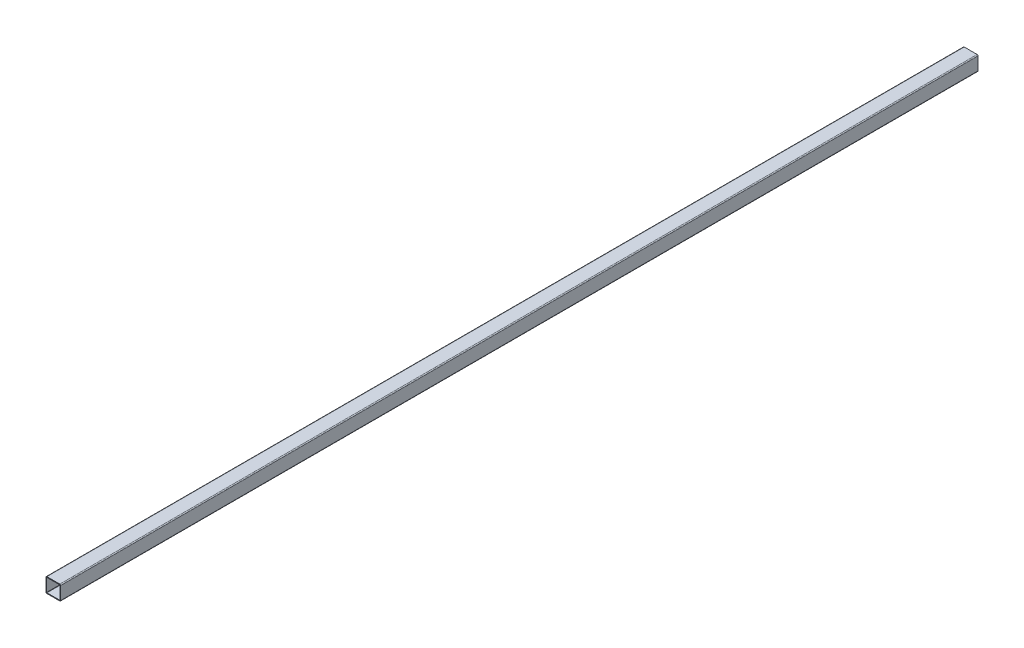
ISO-10303-21;
HEADER;
FILE_DESCRIPTION(('STEP AP214'),'2;1');
FILE_NAME('part.step','',(''),(''),'','','');
FILE_SCHEMA(('AUTOMOTIVE_DESIGN { 1 0 10303 214 1 1 1 1 }'));
ENDSEC;
DATA;
#1=APPLICATION_CONTEXT('core data for automotive mechanical design processes');
#2=APPLICATION_PROTOCOL_DEFINITION('international standard','automotive_design',2000,#1);
#3=PRODUCT_CONTEXT('',#1,'mechanical');
#4=PRODUCT('Part','Part','',(#3));
#5=PRODUCT_RELATED_PRODUCT_CATEGORY('part','',(#4));
#6=PRODUCT_DEFINITION_FORMATION('','',#4);
#7=PRODUCT_DEFINITION_CONTEXT('part definition',#1,'design');
#8=PRODUCT_DEFINITION('design','',#6,#7);
#9=PRODUCT_DEFINITION_SHAPE('','',#8);
#10=(LENGTH_UNIT() NAMED_UNIT(*) SI_UNIT(.MILLI.,.METRE.));
#11=(NAMED_UNIT(*) PLANE_ANGLE_UNIT() SI_UNIT($,.RADIAN.));
#12=(NAMED_UNIT(*) SI_UNIT($,.STERADIAN.) SOLID_ANGLE_UNIT());
#13=UNCERTAINTY_MEASURE_WITH_UNIT(LENGTH_MEASURE(1.E-05),#10,'distance_accuracy_value','');
#14=(GEOMETRIC_REPRESENTATION_CONTEXT(3) GLOBAL_UNCERTAINTY_ASSIGNED_CONTEXT((#13)) GLOBAL_UNIT_ASSIGNED_CONTEXT((#10,
#11,#12)) REPRESENTATION_CONTEXT('',''));
#15=CARTESIAN_POINT('',(0.,0.,0.));
#16=DIRECTION('',(0.,0.,1.));
#17=DIRECTION('',(1.,0.,0.));
#18=AXIS2_PLACEMENT_3D('',#15,#16,#17);
#19=CARTESIAN_POINT('',(14.,-14.,-1000.));
#20=DIRECTION('',(0.,0.,1.));
#21=DIRECTION('',(1.,0.,0.));
#22=AXIS2_PLACEMENT_3D('',#19,#20,#21);
#23=CYLINDRICAL_SURFACE('',#22,2.);
#24=DIRECTION('',(0.,0.,1.));
#25=VECTOR('',#24,1.);
#26=CARTESIAN_POINT('',(16.,-14.,-1000.));
#27=LINE('',#26,#25);
#28=CARTESIAN_POINT('',(16.,-14.,-1000.));
#29=VERTEX_POINT('',#28);
#30=CARTESIAN_POINT('',(16.,-14.,1000.));
#31=VERTEX_POINT('',#30);
#32=EDGE_CURVE('E42',#29,#31,#27,.T.);
#33=ORIENTED_EDGE('',*,*,#32,.T.);
#34=CARTESIAN_POINT('',(14.,-14.,1000.));
#35=DIRECTION('',(0.,0.,1.));
#36=DIRECTION('',(1.,0.,0.));
#37=AXIS2_PLACEMENT_3D('',#34,#35,#36);
#38=CIRCLE('',#37,2.);
#39=CARTESIAN_POINT('',(14.,-16.,1000.));
#40=VERTEX_POINT('',#39);
#41=EDGE_CURVE('E205',#40,#31,#38,.T.);
#42=ORIENTED_EDGE('',*,*,#41,.F.);
#43=DIRECTION('',(0.,0.,1.));
#44=VECTOR('',#43,1.);
#45=CARTESIAN_POINT('',(14.,-16.,-1000.));
#46=LINE('',#45,#44);
#47=CARTESIAN_POINT('',(14.,-16.,-1000.));
#48=VERTEX_POINT('',#47);
#49=EDGE_CURVE('E11',#48,#40,#46,.T.);
#50=ORIENTED_EDGE('',*,*,#49,.F.);
#51=CARTESIAN_POINT('',(14.,-14.,-1000.));
#52=DIRECTION('',(0.,0.,1.));
#53=DIRECTION('',(1.,0.,0.));
#54=AXIS2_PLACEMENT_3D('',#51,#52,#53);
#55=CIRCLE('',#54,2.);
#56=EDGE_CURVE('E265',#48,#29,#55,.T.);
#57=ORIENTED_EDGE('',*,*,#56,.T.);
#58=EDGE_LOOP('',(#33,#42,#50,#57));
#59=FACE_BOUND('',#58,.T.);
#60=ADVANCED_FACE('F39',(#59),#23,.T.);
#61=CARTESIAN_POINT('',(-14.,-16.,-1000.));
#62=DIRECTION('',(0.,-1.,0.));
#63=DIRECTION('',(0.,0.,-1.));
#64=AXIS2_PLACEMENT_3D('',#61,#62,#63);
#65=PLANE('',#64);
#66=ORIENTED_EDGE('',*,*,#49,.T.);
#67=DIRECTION('',(1.,0.,0.));
#68=VECTOR('',#67,1.);
#69=CARTESIAN_POINT('',(-14.,-16.,1000.));
#70=LINE('',#69,#68);
#71=CARTESIAN_POINT('',(-14.,-16.,1000.));
#72=VERTEX_POINT('',#71);
#73=EDGE_CURVE('E233',#72,#40,#70,.T.);
#74=ORIENTED_EDGE('',*,*,#73,.F.);
#75=DIRECTION('',(0.,0.,1.));
#76=VECTOR('',#75,1.);
#77=CARTESIAN_POINT('',(-14.,-16.,-1000.));
#78=LINE('',#77,#76);
#79=CARTESIAN_POINT('',(-14.,-16.,-1000.));
#80=VERTEX_POINT('',#79);
#81=EDGE_CURVE('E48',#80,#72,#78,.T.);
#82=ORIENTED_EDGE('',*,*,#81,.F.);
#83=DIRECTION('',(1.,0.,0.));
#84=VECTOR('',#83,1.);
#85=CARTESIAN_POINT('',(-14.,-16.,-1000.));
#86=LINE('',#85,#84);
#87=EDGE_CURVE('E309',#80,#48,#86,.T.);
#88=ORIENTED_EDGE('',*,*,#87,.T.);
#89=EDGE_LOOP('',(#66,#74,#82,#88));
#90=FACE_BOUND('',#89,.T.);
#91=ADVANCED_FACE('F338',(#90),#65,.T.);
#92=CARTESIAN_POINT('',(-14.,-14.,-1000.));
#93=DIRECTION('',(0.,0.,1.));
#94=DIRECTION('',(1.,0.,0.));
#95=AXIS2_PLACEMENT_3D('',#92,#93,#94);
#96=CYLINDRICAL_SURFACE('',#95,2.);
#97=ORIENTED_EDGE('',*,*,#81,.T.);
#98=CARTESIAN_POINT('',(-14.,-14.,1000.));
#99=DIRECTION('',(0.,0.,1.));
#100=DIRECTION('',(1.,0.,0.));
#101=AXIS2_PLACEMENT_3D('',#98,#99,#100);
#102=CIRCLE('',#101,2.);
#103=CARTESIAN_POINT('',(-16.,-14.,1000.));
#104=VERTEX_POINT('',#103);
#105=EDGE_CURVE('E229',#104,#72,#102,.T.);
#106=ORIENTED_EDGE('',*,*,#105,.F.);
#107=DIRECTION('',(0.,0.,1.));
#108=VECTOR('',#107,1.);
#109=CARTESIAN_POINT('',(-16.,-14.,-1000.));
#110=LINE('',#109,#108);
#111=CARTESIAN_POINT('',(-16.,-14.,-1000.));
#112=VERTEX_POINT('',#111);
#113=EDGE_CURVE('E315',#112,#104,#110,.T.);
#114=ORIENTED_EDGE('',*,*,#113,.F.);
#115=CARTESIAN_POINT('',(-14.,-14.,-1000.));
#116=DIRECTION('',(0.,0.,1.));
#117=DIRECTION('',(1.,0.,0.));
#118=AXIS2_PLACEMENT_3D('',#115,#116,#117);
#119=CIRCLE('',#118,2.);
#120=EDGE_CURVE('E305',#112,#80,#119,.T.);
#121=ORIENTED_EDGE('',*,*,#120,.T.);
#122=EDGE_LOOP('',(#97,#106,#114,#121));
#123=FACE_BOUND('',#122,.T.);
#124=ADVANCED_FACE('F359',(#123),#96,.T.);
#125=CARTESIAN_POINT('',(-16.,-14.,-1000.));
#126=DIRECTION('',(-1.,0.,0.));
#127=DIRECTION('',(0.,0.,1.));
#128=AXIS2_PLACEMENT_3D('',#125,#126,#127);
#129=PLANE('',#128);
#130=ORIENTED_EDGE('',*,*,#113,.T.);
#131=DIRECTION('',(0.,-1.,0.));
#132=VECTOR('',#131,1.);
#133=CARTESIAN_POINT('',(-16.,-14.,1000.));
#134=LINE('',#133,#132);
#135=CARTESIAN_POINT('',(-16.,14.,1000.));
#136=VERTEX_POINT('',#135);
#137=EDGE_CURVE('E225',#136,#104,#134,.T.);
#138=ORIENTED_EDGE('',*,*,#137,.F.);
#139=DIRECTION('',(0.,0.,1.));
#140=VECTOR('',#139,1.);
#141=CARTESIAN_POINT('',(-16.,14.,-1000.));
#142=LINE('',#141,#140);
#143=CARTESIAN_POINT('',(-16.,14.,-1000.));
#144=VERTEX_POINT('',#143);
#145=EDGE_CURVE('E318',#144,#136,#142,.T.);
#146=ORIENTED_EDGE('',*,*,#145,.F.);
#147=DIRECTION('',(0.,-1.,0.));
#148=VECTOR('',#147,1.);
#149=CARTESIAN_POINT('',(-16.,-14.,-1000.));
#150=LINE('',#149,#148);
#151=EDGE_CURVE('E301',#144,#112,#150,.T.);
#152=ORIENTED_EDGE('',*,*,#151,.T.);
#153=EDGE_LOOP('',(#130,#138,#146,#152));
#154=FACE_BOUND('',#153,.T.);
#155=ADVANCED_FACE('F356',(#154),#129,.T.);
#156=CARTESIAN_POINT('',(-14.,14.,-1000.));
#157=DIRECTION('',(0.,0.,1.));
#158=DIRECTION('',(1.,0.,0.));
#159=AXIS2_PLACEMENT_3D('',#156,#157,#158);
#160=CYLINDRICAL_SURFACE('',#159,2.);
#161=ORIENTED_EDGE('',*,*,#145,.T.);
#162=CARTESIAN_POINT('',(-14.,14.,1000.));
#163=DIRECTION('',(0.,0.,1.));
#164=DIRECTION('',(-1.,0.,0.));
#165=AXIS2_PLACEMENT_3D('',#162,#163,#164);
#166=CIRCLE('',#165,2.);
#167=CARTESIAN_POINT('',(-14.,16.,1000.));
#168=VERTEX_POINT('',#167);
#169=EDGE_CURVE('E221',#168,#136,#166,.T.);
#170=ORIENTED_EDGE('',*,*,#169,.F.);
#171=DIRECTION('',(0.,0.,1.));
#172=VECTOR('',#171,1.);
#173=CARTESIAN_POINT('',(-14.,16.,-1000.));
#174=LINE('',#173,#172);
#175=CARTESIAN_POINT('',(-14.,16.,-1000.));
#176=VERTEX_POINT('',#175);
#177=EDGE_CURVE('E321',#176,#168,#174,.T.);
#178=ORIENTED_EDGE('',*,*,#177,.F.);
#179=CARTESIAN_POINT('',(-14.,14.,-1000.));
#180=DIRECTION('',(0.,0.,1.));
#181=DIRECTION('',(-1.,0.,0.));
#182=AXIS2_PLACEMENT_3D('',#179,#180,#181);
#183=CIRCLE('',#182,2.);
#184=EDGE_CURVE('E297',#176,#144,#183,.T.);
#185=ORIENTED_EDGE('',*,*,#184,.T.);
#186=EDGE_LOOP('',(#161,#170,#178,#185));
#187=FACE_BOUND('',#186,.T.);
#188=ADVANCED_FACE('F354',(#187),#160,.T.);
#189=CARTESIAN_POINT('',(-14.,16.,-1000.));
#190=DIRECTION('',(0.,1.,0.));
#191=DIRECTION('',(0.,0.,1.));
#192=AXIS2_PLACEMENT_3D('',#189,#190,#191);
#193=PLANE('',#192);
#194=ORIENTED_EDGE('',*,*,#177,.T.);
#195=DIRECTION('',(-1.,0.,0.));
#196=VECTOR('',#195,1.);
#197=CARTESIAN_POINT('',(-14.,16.,1000.));
#198=LINE('',#197,#196);
#199=CARTESIAN_POINT('',(14.,16.,1000.));
#200=VERTEX_POINT('',#199);
#201=EDGE_CURVE('E217',#200,#168,#198,.T.);
#202=ORIENTED_EDGE('',*,*,#201,.F.);
#203=DIRECTION('',(0.,0.,1.));
#204=VECTOR('',#203,1.);
#205=CARTESIAN_POINT('',(14.,16.,-1000.));
#206=LINE('',#205,#204);
#207=CARTESIAN_POINT('',(14.,16.,-1000.));
#208=VERTEX_POINT('',#207);
#209=EDGE_CURVE('E324',#208,#200,#206,.T.);
#210=ORIENTED_EDGE('',*,*,#209,.F.);
#211=DIRECTION('',(-1.,0.,0.));
#212=VECTOR('',#211,1.);
#213=CARTESIAN_POINT('',(-14.,16.,-1000.));
#214=LINE('',#213,#212);
#215=EDGE_CURVE('E293',#208,#176,#214,.T.);
#216=ORIENTED_EDGE('',*,*,#215,.T.);
#217=EDGE_LOOP('',(#194,#202,#210,#216));
#218=FACE_BOUND('',#217,.T.);
#219=ADVANCED_FACE('F352',(#218),#193,.T.);
#220=CARTESIAN_POINT('',(14.,14.,-1000.));
#221=DIRECTION('',(0.,0.,1.));
#222=DIRECTION('',(1.,0.,0.));
#223=AXIS2_PLACEMENT_3D('',#220,#221,#222);
#224=CYLINDRICAL_SURFACE('',#223,2.);
#225=ORIENTED_EDGE('',*,*,#209,.T.);
#226=CARTESIAN_POINT('',(14.,14.,1000.));
#227=DIRECTION('',(0.,0.,1.));
#228=DIRECTION('',(1.,0.,0.));
#229=AXIS2_PLACEMENT_3D('',#226,#227,#228);
#230=CIRCLE('',#229,2.);
#231=CARTESIAN_POINT('',(16.,14.,1000.));
#232=VERTEX_POINT('',#231);
#233=EDGE_CURVE('E213',#232,#200,#230,.T.);
#234=ORIENTED_EDGE('',*,*,#233,.F.);
#235=DIRECTION('',(0.,0.,1.));
#236=VECTOR('',#235,1.);
#237=CARTESIAN_POINT('',(16.,14.,-1000.));
#238=LINE('',#237,#236);
#239=CARTESIAN_POINT('',(16.,14.,-1000.));
#240=VERTEX_POINT('',#239);
#241=EDGE_CURVE('E326',#240,#232,#238,.T.);
#242=ORIENTED_EDGE('',*,*,#241,.F.);
#243=CARTESIAN_POINT('',(14.,14.,-1000.));
#244=DIRECTION('',(0.,0.,1.));
#245=DIRECTION('',(1.,0.,0.));
#246=AXIS2_PLACEMENT_3D('',#243,#244,#245);
#247=CIRCLE('',#246,2.);
#248=EDGE_CURVE('E289',#240,#208,#247,.T.);
#249=ORIENTED_EDGE('',*,*,#248,.T.);
#250=EDGE_LOOP('',(#225,#234,#242,#249));
#251=FACE_BOUND('',#250,.T.);
#252=ADVANCED_FACE('F348',(#251),#224,.T.);
#253=CARTESIAN_POINT('',(16.,-14.,-1000.));
#254=DIRECTION('',(1.,0.,0.));
#255=DIRECTION('',(0.,0.,-1.));
#256=AXIS2_PLACEMENT_3D('',#253,#254,#255);
#257=PLANE('',#256);
#258=ORIENTED_EDGE('',*,*,#241,.T.);
#259=DIRECTION('',(0.,1.,0.));
#260=VECTOR('',#259,1.);
#261=CARTESIAN_POINT('',(16.,-14.,1000.));
#262=LINE('',#261,#260);
#263=EDGE_CURVE('E209',#31,#232,#262,.T.);
#264=ORIENTED_EDGE('',*,*,#263,.F.);
#265=ORIENTED_EDGE('',*,*,#32,.F.);
#266=DIRECTION('',(0.,1.,0.));
#267=VECTOR('',#266,1.);
#268=CARTESIAN_POINT('',(16.,-14.,-1000.));
#269=LINE('',#268,#267);
#270=EDGE_CURVE('E285',#29,#240,#269,.T.);
#271=ORIENTED_EDGE('',*,*,#270,.T.);
#272=EDGE_LOOP('',(#258,#264,#265,#271));
#273=FACE_BOUND('',#272,.T.);
#274=ADVANCED_FACE('F332',(#273),#257,.T.);
#275=CARTESIAN_POINT('',(14.,-14.,-1000.));
#276=DIRECTION('',(0.,0.,1.));
#277=DIRECTION('',(1.,0.,0.));
#278=AXIS2_PLACEMENT_3D('',#275,#276,#277);
#279=PLANE('',#278);
#280=DIRECTION('',(-1.,0.,0.));
#281=VECTOR('',#280,1.);
#282=CARTESIAN_POINT('',(-14.,14.48,-1000.));
#283=LINE('',#282,#281);
#284=CARTESIAN_POINT('',(14.,14.48,-1000.));
#285=VERTEX_POINT('',#284);
#286=CARTESIAN_POINT('',(-14.,14.48,-1000.));
#287=VERTEX_POINT('',#286);
#288=EDGE_CURVE('E166',#285,#287,#283,.T.);
#289=ORIENTED_EDGE('',*,*,#288,.T.);
#290=CARTESIAN_POINT('',(-14.,14.,-1000.));
#291=DIRECTION('',(0.,0.,1.));
#292=DIRECTION('',(-1.,0.,0.));
#293=AXIS2_PLACEMENT_3D('',#290,#291,#292);
#294=CIRCLE('',#293,0.48);
#295=CARTESIAN_POINT('',(-14.48,14.,-1000.));
#296=VERTEX_POINT('',#295);
#297=EDGE_CURVE('E237',#287,#296,#294,.T.);
#298=ORIENTED_EDGE('',*,*,#297,.T.);
#299=DIRECTION('',(0.,-1.,0.));
#300=VECTOR('',#299,1.);
#301=CARTESIAN_POINT('',(-14.48,-14.,-1000.));
#302=LINE('',#301,#300);
#303=CARTESIAN_POINT('',(-14.48,-14.,-1000.));
#304=VERTEX_POINT('',#303);
#305=EDGE_CURVE('E160',#296,#304,#302,.T.);
#306=ORIENTED_EDGE('',*,*,#305,.T.);
#307=CARTESIAN_POINT('',(-14.,-14.,-1000.));
#308=DIRECTION('',(0.,0.,1.));
#309=DIRECTION('',(1.,0.,0.));
#310=AXIS2_PLACEMENT_3D('',#307,#308,#309);
#311=CIRCLE('',#310,0.48);
#312=CARTESIAN_POINT('',(-14.,-14.48,-1000.));
#313=VERTEX_POINT('',#312);
#314=EDGE_CURVE('E56',#304,#313,#311,.T.);
#315=ORIENTED_EDGE('',*,*,#314,.T.);
#316=DIRECTION('',(1.,0.,0.));
#317=VECTOR('',#316,1.);
#318=CARTESIAN_POINT('',(-14.,-14.48,-1000.));
#319=LINE('',#318,#317);
#320=CARTESIAN_POINT('',(14.,-14.48,-1000.));
#321=VERTEX_POINT('',#320);
#322=EDGE_CURVE('E244',#313,#321,#319,.T.);
#323=ORIENTED_EDGE('',*,*,#322,.T.);
#324=CARTESIAN_POINT('',(14.,-14.,-1000.));
#325=DIRECTION('',(0.,0.,1.));
#326=DIRECTION('',(1.,0.,0.));
#327=AXIS2_PLACEMENT_3D('',#324,#325,#326);
#328=CIRCLE('',#327,0.48);
#329=CARTESIAN_POINT('',(14.48,-14.,-1000.));
#330=VERTEX_POINT('',#329);
#331=EDGE_CURVE('E248',#321,#330,#328,.T.);
#332=ORIENTED_EDGE('',*,*,#331,.T.);
#333=DIRECTION('',(0.,1.,0.));
#334=VECTOR('',#333,1.);
#335=CARTESIAN_POINT('',(14.48,-14.,-1000.));
#336=LINE('',#335,#334);
#337=CARTESIAN_POINT('',(14.48,14.,-1000.));
#338=VERTEX_POINT('',#337);
#339=EDGE_CURVE('E252',#330,#338,#336,.T.);
#340=ORIENTED_EDGE('',*,*,#339,.T.);
#341=CARTESIAN_POINT('',(14.,14.,-1000.));
#342=DIRECTION('',(0.,0.,1.));
#343=DIRECTION('',(1.,0.,0.));
#344=AXIS2_PLACEMENT_3D('',#341,#342,#343);
#345=CIRCLE('',#344,0.48);
#346=EDGE_CURVE('E256',#338,#285,#345,.T.);
#347=ORIENTED_EDGE('',*,*,#346,.T.);
#348=EDGE_LOOP('',(#289,#298,#306,#315,#323,#332,#340,#347));
#349=FACE_BOUND('',#348,.T.);
#350=ORIENTED_EDGE('',*,*,#56,.F.);
#351=ORIENTED_EDGE('',*,*,#87,.F.);
#352=ORIENTED_EDGE('',*,*,#120,.F.);
#353=ORIENTED_EDGE('',*,*,#151,.F.);
#354=ORIENTED_EDGE('',*,*,#184,.F.);
#355=ORIENTED_EDGE('',*,*,#215,.F.);
#356=ORIENTED_EDGE('',*,*,#248,.F.);
#357=ORIENTED_EDGE('',*,*,#270,.F.);
#358=EDGE_LOOP('',(#350,#351,#352,#353,#354,#355,#356,#357));
#359=FACE_BOUND('',#358,.T.);
#360=ADVANCED_FACE('F342',(#349,#359),#279,.F.);
#361=CARTESIAN_POINT('',(-14.,14.,-1000.));
#362=DIRECTION('',(0.,0.,1.));
#363=DIRECTION('',(1.,0.,0.));
#364=AXIS2_PLACEMENT_3D('',#361,#362,#363);
#365=CYLINDRICAL_SURFACE('',#364,0.48);
#366=DIRECTION('',(0.,0.,1.));
#367=VECTOR('',#366,1.);
#368=CARTESIAN_POINT('',(-14.,14.48,-1000.));
#369=LINE('',#368,#367);
#370=CARTESIAN_POINT('',(-14.,14.48,1000.));
#371=VERTEX_POINT('',#370);
#372=EDGE_CURVE('E171',#287,#371,#369,.T.);
#373=ORIENTED_EDGE('',*,*,#372,.T.);
#374=CARTESIAN_POINT('',(-14.,14.,1000.));
#375=DIRECTION('',(0.,0.,1.));
#376=DIRECTION('',(-1.,0.,0.));
#377=AXIS2_PLACEMENT_3D('',#374,#375,#376);
#378=CIRCLE('',#377,0.48);
#379=CARTESIAN_POINT('',(-14.48,14.,1000.));
#380=VERTEX_POINT('',#379);
#381=EDGE_CURVE('E169',#371,#380,#378,.T.);
#382=ORIENTED_EDGE('',*,*,#381,.T.);
#383=DIRECTION('',(0.,0.,1.));
#384=VECTOR('',#383,1.);
#385=CARTESIAN_POINT('',(-14.48,14.,-1000.));
#386=LINE('',#385,#384);
#387=EDGE_CURVE('E153',#296,#380,#386,.T.);
#388=ORIENTED_EDGE('',*,*,#387,.F.);
#389=ORIENTED_EDGE('',*,*,#297,.F.);
#390=EDGE_LOOP('',(#373,#382,#388,#389));
#391=FACE_BOUND('',#390,.T.);
#392=ADVANCED_FACE('F170',(#391),#365,.F.);
#393=CARTESIAN_POINT('',(-14.,14.48,-1000.));
#394=DIRECTION('',(0.,1.,0.));
#395=DIRECTION('',(0.,0.,1.));
#396=AXIS2_PLACEMENT_3D('',#393,#394,#395);
#397=PLANE('',#396);
#398=DIRECTION('',(0.,0.,1.));
#399=VECTOR('',#398,1.);
#400=CARTESIAN_POINT('',(14.,14.48,-1000.));
#401=LINE('',#400,#399);
#402=CARTESIAN_POINT('',(14.,14.48,1000.));
#403=VERTEX_POINT('',#402);
#404=EDGE_CURVE('E266',#285,#403,#401,.T.);
#405=ORIENTED_EDGE('',*,*,#404,.T.);
#406=DIRECTION('',(-1.,0.,0.));
#407=VECTOR('',#406,1.);
#408=CARTESIAN_POINT('',(-14.,14.48,1000.));
#409=LINE('',#408,#407);
#410=EDGE_CURVE('E202',#403,#371,#409,.T.);
#411=ORIENTED_EDGE('',*,*,#410,.T.);
#412=ORIENTED_EDGE('',*,*,#372,.F.);
#413=ORIENTED_EDGE('',*,*,#288,.F.);
#414=EDGE_LOOP('',(#405,#411,#412,#413));
#415=FACE_BOUND('',#414,.T.);
#416=ADVANCED_FACE('F434',(#415),#397,.F.);
#417=CARTESIAN_POINT('',(14.,14.,-1000.));
#418=DIRECTION('',(0.,0.,1.));
#419=DIRECTION('',(1.,0.,0.));
#420=AXIS2_PLACEMENT_3D('',#417,#418,#419);
#421=CYLINDRICAL_SURFACE('',#420,0.48);
#422=DIRECTION('',(0.,0.,1.));
#423=VECTOR('',#422,1.);
#424=CARTESIAN_POINT('',(14.48,14.,-1000.));
#425=LINE('',#424,#423);
#426=CARTESIAN_POINT('',(14.48,14.,1000.));
#427=VERTEX_POINT('',#426);
#428=EDGE_CURVE('E269',#338,#427,#425,.T.);
#429=ORIENTED_EDGE('',*,*,#428,.T.);
#430=CARTESIAN_POINT('',(14.,14.,1000.));
#431=DIRECTION('',(0.,0.,1.));
#432=DIRECTION('',(1.,0.,0.));
#433=AXIS2_PLACEMENT_3D('',#430,#431,#432);
#434=CIRCLE('',#433,0.48);
#435=EDGE_CURVE('E198',#427,#403,#434,.T.);
#436=ORIENTED_EDGE('',*,*,#435,.T.);
#437=ORIENTED_EDGE('',*,*,#404,.F.);
#438=ORIENTED_EDGE('',*,*,#346,.F.);
#439=EDGE_LOOP('',(#429,#436,#437,#438));
#440=FACE_BOUND('',#439,.T.);
#441=ADVANCED_FACE('F443',(#440),#421,.F.);
#442=CARTESIAN_POINT('',(14.48,-14.,-1000.));
#443=DIRECTION('',(1.,0.,0.));
#444=DIRECTION('',(0.,0.,-1.));
#445=AXIS2_PLACEMENT_3D('',#442,#443,#444);
#446=PLANE('',#445);
#447=DIRECTION('',(0.,0.,1.));
#448=VECTOR('',#447,1.);
#449=CARTESIAN_POINT('',(14.48,-14.,-1000.));
#450=LINE('',#449,#448);
#451=CARTESIAN_POINT('',(14.48,-14.,1000.));
#452=VERTEX_POINT('',#451);
#453=EDGE_CURVE('E272',#330,#452,#450,.T.);
#454=ORIENTED_EDGE('',*,*,#453,.T.);
#455=DIRECTION('',(0.,1.,0.));
#456=VECTOR('',#455,1.);
#457=CARTESIAN_POINT('',(14.48,-14.,1000.));
#458=LINE('',#457,#456);
#459=EDGE_CURVE('E194',#452,#427,#458,.T.);
#460=ORIENTED_EDGE('',*,*,#459,.T.);
#461=ORIENTED_EDGE('',*,*,#428,.F.);
#462=ORIENTED_EDGE('',*,*,#339,.F.);
#463=EDGE_LOOP('',(#454,#460,#461,#462));
#464=FACE_BOUND('',#463,.T.);
#465=ADVANCED_FACE('F453',(#464),#446,.F.);
#466=CARTESIAN_POINT('',(14.,-14.,-1000.));
#467=DIRECTION('',(0.,0.,1.));
#468=DIRECTION('',(1.,0.,0.));
#469=AXIS2_PLACEMENT_3D('',#466,#467,#468);
#470=CYLINDRICAL_SURFACE('',#469,0.48);
#471=DIRECTION('',(0.,0.,1.));
#472=VECTOR('',#471,1.);
#473=CARTESIAN_POINT('',(14.,-14.48,-1000.));
#474=LINE('',#473,#472);
#475=CARTESIAN_POINT('',(14.,-14.48,1000.));
#476=VERTEX_POINT('',#475);
#477=EDGE_CURVE('E275',#321,#476,#474,.T.);
#478=ORIENTED_EDGE('',*,*,#477,.T.);
#479=CARTESIAN_POINT('',(14.,-14.,1000.));
#480=DIRECTION('',(0.,0.,1.));
#481=DIRECTION('',(1.,0.,0.));
#482=AXIS2_PLACEMENT_3D('',#479,#480,#481);
#483=CIRCLE('',#482,0.48);
#484=EDGE_CURVE('E190',#476,#452,#483,.T.);
#485=ORIENTED_EDGE('',*,*,#484,.T.);
#486=ORIENTED_EDGE('',*,*,#453,.F.);
#487=ORIENTED_EDGE('',*,*,#331,.F.);
#488=EDGE_LOOP('',(#478,#485,#486,#487));
#489=FACE_BOUND('',#488,.T.);
#490=ADVANCED_FACE('F463',(#489),#470,.F.);
#491=CARTESIAN_POINT('',(-14.,-14.48,-1000.));
#492=DIRECTION('',(0.,-1.,0.));
#493=DIRECTION('',(0.,0.,-1.));
#494=AXIS2_PLACEMENT_3D('',#491,#492,#493);
#495=PLANE('',#494);
#496=DIRECTION('',(0.,0.,1.));
#497=VECTOR('',#496,1.);
#498=CARTESIAN_POINT('',(-14.,-14.48,-1000.));
#499=LINE('',#498,#497);
#500=CARTESIAN_POINT('',(-14.,-14.48,1000.));
#501=VERTEX_POINT('',#500);
#502=EDGE_CURVE('E278',#313,#501,#499,.T.);
#503=ORIENTED_EDGE('',*,*,#502,.T.);
#504=DIRECTION('',(1.,0.,0.));
#505=VECTOR('',#504,1.);
#506=CARTESIAN_POINT('',(-14.,-14.48,1000.));
#507=LINE('',#506,#505);
#508=EDGE_CURVE('E184',#501,#476,#507,.T.);
#509=ORIENTED_EDGE('',*,*,#508,.T.);
#510=ORIENTED_EDGE('',*,*,#477,.F.);
#511=ORIENTED_EDGE('',*,*,#322,.F.);
#512=EDGE_LOOP('',(#503,#509,#510,#511));
#513=FACE_BOUND('',#512,.T.);
#514=ADVANCED_FACE('F473',(#513),#495,.F.);
#515=CARTESIAN_POINT('',(-14.,-14.,-1000.));
#516=DIRECTION('',(0.,0.,1.));
#517=DIRECTION('',(1.,0.,0.));
#518=AXIS2_PLACEMENT_3D('',#515,#516,#517);
#519=CYLINDRICAL_SURFACE('',#518,0.48);
#520=DIRECTION('',(0.,0.,1.));
#521=VECTOR('',#520,1.);
#522=CARTESIAN_POINT('',(-14.48,-14.,-1000.));
#523=LINE('',#522,#521);
#524=CARTESIAN_POINT('',(-14.48,-14.,1000.));
#525=VERTEX_POINT('',#524);
#526=EDGE_CURVE('E165',#304,#525,#523,.T.);
#527=ORIENTED_EDGE('',*,*,#526,.T.);
#528=CARTESIAN_POINT('',(-14.,-14.,1000.));
#529=DIRECTION('',(0.,0.,1.));
#530=DIRECTION('',(1.,0.,0.));
#531=AXIS2_PLACEMENT_3D('',#528,#529,#530);
#532=CIRCLE('',#531,0.48);
#533=EDGE_CURVE('E180',#525,#501,#532,.T.);
#534=ORIENTED_EDGE('',*,*,#533,.T.);
#535=ORIENTED_EDGE('',*,*,#502,.F.);
#536=ORIENTED_EDGE('',*,*,#314,.F.);
#537=EDGE_LOOP('',(#527,#534,#535,#536));
#538=FACE_BOUND('',#537,.T.);
#539=ADVANCED_FACE('F483',(#538),#519,.F.);
#540=CARTESIAN_POINT('',(-14.48,-14.,-1000.));
#541=DIRECTION('',(-1.,0.,0.));
#542=DIRECTION('',(0.,0.,1.));
#543=AXIS2_PLACEMENT_3D('',#540,#541,#542);
#544=PLANE('',#543);
#545=ORIENTED_EDGE('',*,*,#387,.T.);
#546=DIRECTION('',(0.,-1.,0.));
#547=VECTOR('',#546,1.);
#548=CARTESIAN_POINT('',(-14.48,-14.,1000.));
#549=LINE('',#548,#547);
#550=EDGE_CURVE('E157',#380,#525,#549,.T.);
#551=ORIENTED_EDGE('',*,*,#550,.T.);
#552=ORIENTED_EDGE('',*,*,#526,.F.);
#553=ORIENTED_EDGE('',*,*,#305,.F.);
#554=EDGE_LOOP('',(#545,#551,#552,#553));
#555=FACE_BOUND('',#554,.T.);
#556=ADVANCED_FACE('F155',(#555),#544,.F.);
#557=CARTESIAN_POINT('',(14.,-14.,1000.));
#558=DIRECTION('',(0.,0.,1.));
#559=DIRECTION('',(1.,0.,0.));
#560=AXIS2_PLACEMENT_3D('',#557,#558,#559);
#561=PLANE('',#560);
#562=ORIENTED_EDGE('',*,*,#41,.T.);
#563=ORIENTED_EDGE('',*,*,#263,.T.);
#564=ORIENTED_EDGE('',*,*,#233,.T.);
#565=ORIENTED_EDGE('',*,*,#201,.T.);
#566=ORIENTED_EDGE('',*,*,#169,.T.);
#567=ORIENTED_EDGE('',*,*,#137,.T.);
#568=ORIENTED_EDGE('',*,*,#105,.T.);
#569=ORIENTED_EDGE('',*,*,#73,.T.);
#570=EDGE_LOOP('',(#562,#563,#564,#565,#566,#567,#568,#569));
#571=FACE_BOUND('',#570,.T.);
#572=ORIENTED_EDGE('',*,*,#550,.F.);
#573=ORIENTED_EDGE('',*,*,#381,.F.);
#574=ORIENTED_EDGE('',*,*,#410,.F.);
#575=ORIENTED_EDGE('',*,*,#435,.F.);
#576=ORIENTED_EDGE('',*,*,#459,.F.);
#577=ORIENTED_EDGE('',*,*,#484,.F.);
#578=ORIENTED_EDGE('',*,*,#508,.F.);
#579=ORIENTED_EDGE('',*,*,#533,.F.);
#580=EDGE_LOOP('',(#572,#573,#574,#575,#576,#577,#578,#579));
#581=FACE_BOUND('',#580,.T.);
#582=ADVANCED_FACE('F177',(#571,#581),#561,.T.);
#583=CLOSED_SHELL('',(#60,#91,#124,#155,#188,#219,#252,#274,#360,#392,#416,#441,#465,#490,#514,
#539,#556,#582));
#584=MANIFOLD_SOLID_BREP('B2',#583);
#585=ADVANCED_BREP_SHAPE_REPRESENTATION('',(#18,#584),#14);
#586=SHAPE_DEFINITION_REPRESENTATION(#9,#585);
ENDSEC;
END-ISO-10303-21;
